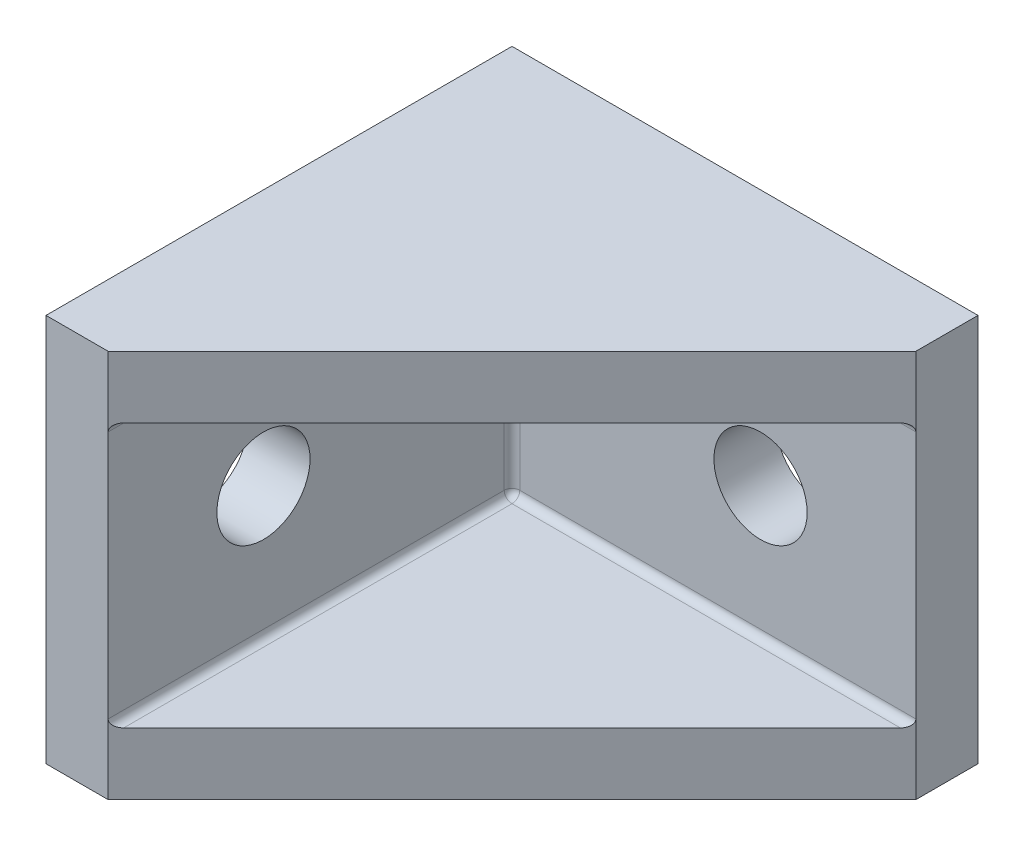
ISO-10303-21;
HEADER;
FILE_DESCRIPTION(('STEP AP214'),'2;1');
FILE_NAME('part.step','',(''),(''),'','','');
FILE_SCHEMA(('AUTOMOTIVE_DESIGN { 1 0 10303 214 1 1 1 1 }'));
ENDSEC;
DATA;
#1=APPLICATION_CONTEXT('core data for automotive mechanical design processes');
#2=APPLICATION_PROTOCOL_DEFINITION('international standard','automotive_design',2000,#1);
#3=PRODUCT_CONTEXT('',#1,'mechanical');
#4=PRODUCT('Part','Part','',(#3));
#5=PRODUCT_RELATED_PRODUCT_CATEGORY('part','',(#4));
#6=PRODUCT_DEFINITION_FORMATION('','',#4);
#7=PRODUCT_DEFINITION_CONTEXT('part definition',#1,'design');
#8=PRODUCT_DEFINITION('design','',#6,#7);
#9=PRODUCT_DEFINITION_SHAPE('','',#8);
#10=(LENGTH_UNIT() NAMED_UNIT(*) SI_UNIT(.MILLI.,.METRE.));
#11=(NAMED_UNIT(*) PLANE_ANGLE_UNIT() SI_UNIT($,.RADIAN.));
#12=(NAMED_UNIT(*) SI_UNIT($,.STERADIAN.) SOLID_ANGLE_UNIT());
#13=UNCERTAINTY_MEASURE_WITH_UNIT(LENGTH_MEASURE(1.E-05),#10,'distance_accuracy_value','');
#14=(GEOMETRIC_REPRESENTATION_CONTEXT(3) GLOBAL_UNCERTAINTY_ASSIGNED_CONTEXT((#13)) GLOBAL_UNIT_ASSIGNED_CONTEXT((#10,
#11,#12)) REPRESENTATION_CONTEXT('',''));
#15=CARTESIAN_POINT('',(0.,0.,0.));
#16=DIRECTION('',(0.,0.,1.));
#17=DIRECTION('',(1.,0.,0.));
#18=AXIS2_PLACEMENT_3D('',#15,#16,#17);
#19=CARTESIAN_POINT('',(30.,12.5,4.));
#20=DIRECTION('',(-0.707106781186547,0.,-0.707106781186547));
#21=DIRECTION('',(-0.707106781186548,0.,0.707106781186548));
#22=AXIS2_PLACEMENT_3D('',#19,#20,#21);
#23=PLANE('',#22);
#24=DIRECTION('',(0.707106781186548,0.,-0.707106781186548));
#25=VECTOR('',#24,1.);
#26=CARTESIAN_POINT('',(30.,-8.5,4.));
#27=LINE('',#26,#25);
#28=CARTESIAN_POINT('',(4.5,-8.5,29.5));
#29=VERTEX_POINT('',#28);
#30=CARTESIAN_POINT('',(29.5,-8.5,4.5));
#31=VERTEX_POINT('',#30);
#32=EDGE_CURVE('E131',#29,#31,#27,.T.);
#33=ORIENTED_EDGE('',*,*,#32,.F.);
#34=CARTESIAN_POINT('',(4.5,-8.,29.5));
#35=DIRECTION('',(-0.707106781186547,0.,-0.707106781186547));
#36=DIRECTION('',(0.707106781186548,0.,-0.707106781186548));
#37=AXIS2_PLACEMENT_3D('',#34,#35,#36);
#38=ELLIPSE('',#37,0.707106781186548,0.5);
#39=CARTESIAN_POINT('',(4.,-8.,30.));
#40=VERTEX_POINT('',#39);
#41=EDGE_CURVE('E11',#29,#40,#38,.T.);
#42=ORIENTED_EDGE('',*,*,#41,.T.);
#43=DIRECTION('',(0.,-1.,0.));
#44=VECTOR('',#43,1.);
#45=CARTESIAN_POINT('',(4.,12.5,30.));
#46=LINE('',#45,#44);
#47=CARTESIAN_POINT('',(4.,-12.5,30.));
#48=VERTEX_POINT('',#47);
#49=EDGE_CURVE('E52',#40,#48,#46,.T.);
#50=ORIENTED_EDGE('',*,*,#49,.T.);
#51=DIRECTION('',(0.707106781186547,0.,-0.707106781186547));
#52=VECTOR('',#51,1.);
#53=CARTESIAN_POINT('',(30.,-12.5,4.));
#54=LINE('',#53,#52);
#55=CARTESIAN_POINT('',(30.,-12.5,4.));
#56=VERTEX_POINT('',#55);
#57=EDGE_CURVE('E214',#48,#56,#54,.T.);
#58=ORIENTED_EDGE('',*,*,#57,.T.);
#59=DIRECTION('',(0.,-1.,0.));
#60=VECTOR('',#59,1.);
#61=CARTESIAN_POINT('',(30.,12.5,4.));
#62=LINE('',#61,#60);
#63=CARTESIAN_POINT('',(30.,-8.,4.));
#64=VERTEX_POINT('',#63);
#65=EDGE_CURVE('E80',#64,#56,#62,.T.);
#66=ORIENTED_EDGE('',*,*,#65,.F.);
#67=CARTESIAN_POINT('',(29.5,-8.,4.5));
#68=DIRECTION('',(-0.707106781186547,0.,-0.707106781186547));
#69=DIRECTION('',(0.707106781186548,0.,-0.707106781186548));
#70=AXIS2_PLACEMENT_3D('',#67,#68,#69);
#71=ELLIPSE('',#70,0.707106781186548,0.5);
#72=EDGE_CURVE('E44',#64,#31,#71,.T.);
#73=ORIENTED_EDGE('',*,*,#72,.T.);
#74=EDGE_LOOP('',(#33,#42,#50,#58,#66,#73));
#75=FACE_BOUND('',#74,.T.);
#76=ADVANCED_FACE('F35',(#75),#23,.F.);
#77=CARTESIAN_POINT('',(0.,12.5,0.));
#78=DIRECTION('',(0.,0.,1.));
#79=DIRECTION('',(1.,0.,0.));
#80=AXIS2_PLACEMENT_3D('',#77,#78,#79);
#81=PLANE('',#80);
#82=CARTESIAN_POINT('',(20.,0.,0.));
#83=DIRECTION('',(0.,0.,1.));
#84=DIRECTION('',(1.,0.,0.));
#85=AXIS2_PLACEMENT_3D('',#82,#83,#84);
#86=CIRCLE('',#85,3.);
#87=CARTESIAN_POINT('',(23.,0.,0.));
#88=VERTEX_POINT('',#87);
#89=EDGE_CURVE('E176',#88,#88,#86,.T.);
#90=ORIENTED_EDGE('',*,*,#89,.T.);
#91=EDGE_LOOP('',(#90));
#92=FACE_BOUND('',#91,.T.);
#93=DIRECTION('',(-1.,0.,0.));
#94=VECTOR('',#93,1.);
#95=CARTESIAN_POINT('',(0.,-12.5,0.));
#96=LINE('',#95,#94);
#97=CARTESIAN_POINT('',(30.,-12.5,0.));
#98=VERTEX_POINT('',#97);
#99=CARTESIAN_POINT('',(0.,-12.5,0.));
#100=VERTEX_POINT('',#99);
#101=EDGE_CURVE('E190',#98,#100,#96,.T.);
#102=ORIENTED_EDGE('',*,*,#101,.T.);
#103=DIRECTION('',(0.,-1.,0.));
#104=VECTOR('',#103,1.);
#105=CARTESIAN_POINT('',(0.,12.5,0.));
#106=LINE('',#105,#104);
#107=CARTESIAN_POINT('',(0.,12.5,0.));
#108=VERTEX_POINT('',#107);
#109=EDGE_CURVE('E225',#108,#100,#106,.T.);
#110=ORIENTED_EDGE('',*,*,#109,.F.);
#111=DIRECTION('',(-1.,0.,0.));
#112=VECTOR('',#111,1.);
#113=CARTESIAN_POINT('',(0.,12.5,0.));
#114=LINE('',#113,#112);
#115=CARTESIAN_POINT('',(30.,12.5,0.));
#116=VERTEX_POINT('',#115);
#117=EDGE_CURVE('E195',#116,#108,#114,.T.);
#118=ORIENTED_EDGE('',*,*,#117,.F.);
#119=DIRECTION('',(0.,-1.,0.));
#120=VECTOR('',#119,1.);
#121=CARTESIAN_POINT('',(30.,12.5,0.));
#122=LINE('',#121,#120);
#123=EDGE_CURVE('E207',#116,#98,#122,.T.);
#124=ORIENTED_EDGE('',*,*,#123,.T.);
#125=EDGE_LOOP('',(#102,#110,#118,#124));
#126=FACE_BOUND('',#125,.T.);
#127=ADVANCED_FACE('F267',(#92,#126),#81,.F.);
#128=CARTESIAN_POINT('',(0.,12.5,0.));
#129=DIRECTION('',(1.,0.,0.));
#130=DIRECTION('',(0.,0.,-1.));
#131=AXIS2_PLACEMENT_3D('',#128,#129,#130);
#132=PLANE('',#131);
#133=CARTESIAN_POINT('',(0.,0.,20.));
#134=DIRECTION('',(1.,0.,0.));
#135=DIRECTION('',(0.,0.,-1.));
#136=AXIS2_PLACEMENT_3D('',#133,#134,#135);
#137=CIRCLE('',#136,3.);
#138=CARTESIAN_POINT('',(0.,0.,17.));
#139=VERTEX_POINT('',#138);
#140=EDGE_CURVE('E144',#139,#139,#137,.T.);
#141=ORIENTED_EDGE('',*,*,#140,.T.);
#142=EDGE_LOOP('',(#141));
#143=FACE_BOUND('',#142,.T.);
#144=DIRECTION('',(0.,0.,1.));
#145=VECTOR('',#144,1.);
#146=CARTESIAN_POINT('',(0.,-12.5,0.));
#147=LINE('',#146,#145);
#148=CARTESIAN_POINT('',(0.,-12.5,30.));
#149=VERTEX_POINT('',#148);
#150=EDGE_CURVE('E210',#100,#149,#147,.T.);
#151=ORIENTED_EDGE('',*,*,#150,.T.);
#152=DIRECTION('',(0.,-1.,0.));
#153=VECTOR('',#152,1.);
#154=CARTESIAN_POINT('',(0.,12.5,30.));
#155=LINE('',#154,#153);
#156=CARTESIAN_POINT('',(0.,12.5,30.));
#157=VERTEX_POINT('',#156);
#158=EDGE_CURVE('E222',#157,#149,#155,.T.);
#159=ORIENTED_EDGE('',*,*,#158,.F.);
#160=DIRECTION('',(0.,0.,1.));
#161=VECTOR('',#160,1.);
#162=CARTESIAN_POINT('',(0.,12.5,0.));
#163=LINE('',#162,#161);
#164=EDGE_CURVE('E197',#108,#157,#163,.T.);
#165=ORIENTED_EDGE('',*,*,#164,.F.);
#166=ORIENTED_EDGE('',*,*,#109,.T.);
#167=EDGE_LOOP('',(#151,#159,#165,#166));
#168=FACE_BOUND('',#167,.T.);
#169=ADVANCED_FACE('F298',(#143,#168),#132,.F.);
#170=CARTESIAN_POINT('',(0.,12.5,30.));
#171=DIRECTION('',(0.,0.,-1.));
#172=DIRECTION('',(-1.,0.,0.));
#173=AXIS2_PLACEMENT_3D('',#170,#171,#172);
#174=PLANE('',#173);
#175=DIRECTION('',(1.,0.,0.));
#176=VECTOR('',#175,1.);
#177=CARTESIAN_POINT('',(0.,-12.5,30.));
#178=LINE('',#177,#176);
#179=EDGE_CURVE('E212',#149,#48,#178,.T.);
#180=ORIENTED_EDGE('',*,*,#179,.T.);
#181=ORIENTED_EDGE('',*,*,#49,.F.);
#182=DIRECTION('',(0.,-1.,0.));
#183=VECTOR('',#182,1.);
#184=CARTESIAN_POINT('',(4.,12.5,30.));
#185=LINE('',#184,#183);
#186=CARTESIAN_POINT('',(4.,8.,30.));
#187=VERTEX_POINT('',#186);
#188=EDGE_CURVE('E188',#187,#40,#185,.T.);
#189=ORIENTED_EDGE('',*,*,#188,.F.);
#190=CARTESIAN_POINT('',(4.,12.5,30.));
#191=VERTEX_POINT('',#190);
#192=EDGE_CURVE('E220',#191,#187,#46,.T.);
#193=ORIENTED_EDGE('',*,*,#192,.F.);
#194=DIRECTION('',(1.,0.,0.));
#195=VECTOR('',#194,1.);
#196=CARTESIAN_POINT('',(0.,12.5,30.));
#197=LINE('',#196,#195);
#198=EDGE_CURVE('E201',#157,#191,#197,.T.);
#199=ORIENTED_EDGE('',*,*,#198,.F.);
#200=ORIENTED_EDGE('',*,*,#158,.T.);
#201=EDGE_LOOP('',(#180,#181,#189,#193,#199,#200));
#202=FACE_BOUND('',#201,.T.);
#203=ADVANCED_FACE('F279',(#202),#174,.F.);
#204=ORIENTED_EDGE('',*,*,#192,.T.);
#205=CARTESIAN_POINT('',(4.5,8.,29.5));
#206=DIRECTION('',(-0.707106781186547,0.,-0.707106781186547));
#207=DIRECTION('',(-0.707106781186548,0.,0.707106781186548));
#208=AXIS2_PLACEMENT_3D('',#205,#206,#207);
#209=ELLIPSE('',#208,0.707106781186548,0.5);
#210=CARTESIAN_POINT('',(4.5,8.5,29.5));
#211=VERTEX_POINT('',#210);
#212=EDGE_CURVE('E136',#187,#211,#209,.T.);
#213=ORIENTED_EDGE('',*,*,#212,.T.);
#214=DIRECTION('',(0.707106781186548,0.,-0.707106781186548));
#215=VECTOR('',#214,1.);
#216=CARTESIAN_POINT('',(30.,8.5,4.));
#217=LINE('',#216,#215);
#218=CARTESIAN_POINT('',(29.5,8.5,4.5));
#219=VERTEX_POINT('',#218);
#220=EDGE_CURVE('E143',#211,#219,#217,.T.);
#221=ORIENTED_EDGE('',*,*,#220,.T.);
#222=CARTESIAN_POINT('',(29.5,8.,4.5));
#223=DIRECTION('',(-0.707106781186547,0.,-0.707106781186547));
#224=DIRECTION('',(-0.707106781186548,0.,0.707106781186548));
#225=AXIS2_PLACEMENT_3D('',#222,#223,#224);
#226=ELLIPSE('',#225,0.707106781186548,0.5);
#227=CARTESIAN_POINT('',(30.,8.,4.));
#228=VERTEX_POINT('',#227);
#229=EDGE_CURVE('E151',#219,#228,#226,.T.);
#230=ORIENTED_EDGE('',*,*,#229,.T.);
#231=CARTESIAN_POINT('',(30.,12.5,4.));
#232=VERTEX_POINT('',#231);
#233=EDGE_CURVE('E61',#232,#228,#62,.T.);
#234=ORIENTED_EDGE('',*,*,#233,.F.);
#235=DIRECTION('',(0.707106781186547,0.,-0.707106781186547));
#236=VECTOR('',#235,1.);
#237=CARTESIAN_POINT('',(30.,12.5,4.));
#238=LINE('',#237,#236);
#239=EDGE_CURVE('E204',#191,#232,#238,.T.);
#240=ORIENTED_EDGE('',*,*,#239,.F.);
#241=EDGE_LOOP('',(#204,#213,#221,#230,#234,#240));
#242=FACE_BOUND('',#241,.T.);
#243=ADVANCED_FACE('F251',(#242),#23,.F.);
#244=CARTESIAN_POINT('',(30.,12.5,4.));
#245=DIRECTION('',(-1.,0.,0.));
#246=DIRECTION('',(0.,0.,1.));
#247=AXIS2_PLACEMENT_3D('',#244,#245,#246);
#248=PLANE('',#247);
#249=DIRECTION('',(0.,0.,-1.));
#250=VECTOR('',#249,1.);
#251=CARTESIAN_POINT('',(30.,-12.5,4.));
#252=LINE('',#251,#250);
#253=EDGE_CURVE('E198',#56,#98,#252,.T.);
#254=ORIENTED_EDGE('',*,*,#253,.T.);
#255=ORIENTED_EDGE('',*,*,#123,.F.);
#256=DIRECTION('',(0.,0.,-1.));
#257=VECTOR('',#256,1.);
#258=CARTESIAN_POINT('',(30.,12.5,4.));
#259=LINE('',#258,#257);
#260=EDGE_CURVE('E90',#232,#116,#259,.T.);
#261=ORIENTED_EDGE('',*,*,#260,.F.);
#262=ORIENTED_EDGE('',*,*,#233,.T.);
#263=DIRECTION('',(0.,-1.,0.));
#264=VECTOR('',#263,1.);
#265=CARTESIAN_POINT('',(30.,12.5,4.));
#266=LINE('',#265,#264);
#267=EDGE_CURVE('E191',#228,#64,#266,.T.);
#268=ORIENTED_EDGE('',*,*,#267,.T.);
#269=ORIENTED_EDGE('',*,*,#65,.T.);
#270=EDGE_LOOP('',(#254,#255,#261,#262,#268,#269));
#271=FACE_BOUND('',#270,.T.);
#272=ADVANCED_FACE('F258',(#271),#248,.F.);
#273=CARTESIAN_POINT('',(0.,12.5,0.));
#274=DIRECTION('',(0.,1.,0.));
#275=DIRECTION('',(0.,0.,1.));
#276=AXIS2_PLACEMENT_3D('',#273,#274,#275);
#277=PLANE('',#276);
#278=ORIENTED_EDGE('',*,*,#117,.T.);
#279=ORIENTED_EDGE('',*,*,#164,.T.);
#280=ORIENTED_EDGE('',*,*,#198,.T.);
#281=ORIENTED_EDGE('',*,*,#239,.T.);
#282=ORIENTED_EDGE('',*,*,#260,.T.);
#283=EDGE_LOOP('',(#278,#279,#280,#281,#282));
#284=FACE_BOUND('',#283,.T.);
#285=ADVANCED_FACE('F269',(#284),#277,.T.);
#286=CARTESIAN_POINT('',(0.,-12.5,0.));
#287=DIRECTION('',(0.,1.,0.));
#288=DIRECTION('',(0.,0.,1.));
#289=AXIS2_PLACEMENT_3D('',#286,#287,#288);
#290=PLANE('',#289);
#291=ORIENTED_EDGE('',*,*,#101,.F.);
#292=ORIENTED_EDGE('',*,*,#253,.F.);
#293=ORIENTED_EDGE('',*,*,#57,.F.);
#294=ORIENTED_EDGE('',*,*,#179,.F.);
#295=ORIENTED_EDGE('',*,*,#150,.F.);
#296=EDGE_LOOP('',(#291,#292,#293,#294,#295));
#297=FACE_BOUND('',#296,.T.);
#298=ADVANCED_FACE('F264',(#297),#290,.F.);
#299=CARTESIAN_POINT('',(0.,12.5,4.));
#300=DIRECTION('',(0.,0.,1.));
#301=DIRECTION('',(1.,0.,0.));
#302=AXIS2_PLACEMENT_3D('',#299,#300,#301);
#303=PLANE('',#302);
#304=CARTESIAN_POINT('',(20.,0.,4.));
#305=DIRECTION('',(0.,0.,1.));
#306=DIRECTION('',(1.,0.,0.));
#307=AXIS2_PLACEMENT_3D('',#304,#305,#306);
#308=CIRCLE('',#307,3.);
#309=CARTESIAN_POINT('',(23.,0.,4.));
#310=VERTEX_POINT('',#309);
#311=EDGE_CURVE('E173',#310,#310,#308,.T.);
#312=ORIENTED_EDGE('',*,*,#311,.F.);
#313=EDGE_LOOP('',(#312));
#314=FACE_BOUND('',#313,.T.);
#315=ORIENTED_EDGE('',*,*,#267,.F.);
#316=DIRECTION('',(-1.,0.,0.));
#317=VECTOR('',#316,1.);
#318=CARTESIAN_POINT('',(0.,8.,4.));
#319=LINE('',#318,#317);
#320=CARTESIAN_POINT('',(4.5,8.,4.));
#321=VERTEX_POINT('',#320);
#322=EDGE_CURVE('E233',#228,#321,#319,.T.);
#323=ORIENTED_EDGE('',*,*,#322,.T.);
#324=DIRECTION('',(0.,-1.,0.));
#325=VECTOR('',#324,1.);
#326=CARTESIAN_POINT('',(4.5,-8.5,4.));
#327=LINE('',#326,#325);
#328=CARTESIAN_POINT('',(4.5,-8.,4.));
#329=VERTEX_POINT('',#328);
#330=EDGE_CURVE('E230',#321,#329,#327,.T.);
#331=ORIENTED_EDGE('',*,*,#330,.T.);
#332=DIRECTION('',(-1.,0.,0.));
#333=VECTOR('',#332,1.);
#334=CARTESIAN_POINT('',(30.,-8.,4.));
#335=LINE('',#334,#333);
#336=EDGE_CURVE('E228',#329,#64,#335,.F.);
#337=ORIENTED_EDGE('',*,*,#336,.T.);
#338=EDGE_LOOP('',(#315,#323,#331,#337));
#339=FACE_BOUND('',#338,.T.);
#340=ADVANCED_FACE('F256',(#314,#339),#303,.T.);
#341=CARTESIAN_POINT('',(4.,12.5,0.));
#342=DIRECTION('',(1.,0.,0.));
#343=DIRECTION('',(0.,0.,-1.));
#344=AXIS2_PLACEMENT_3D('',#341,#342,#343);
#345=PLANE('',#344);
#346=CARTESIAN_POINT('',(4.,0.,20.));
#347=DIRECTION('',(1.,0.,0.));
#348=DIRECTION('',(0.,0.,-1.));
#349=AXIS2_PLACEMENT_3D('',#346,#347,#348);
#350=CIRCLE('',#349,3.);
#351=CARTESIAN_POINT('',(4.,0.,17.));
#352=VERTEX_POINT('',#351);
#353=EDGE_CURVE('E181',#352,#352,#350,.T.);
#354=ORIENTED_EDGE('',*,*,#353,.F.);
#355=EDGE_LOOP('',(#354));
#356=FACE_BOUND('',#355,.T.);
#357=DIRECTION('',(0.,-1.,0.));
#358=VECTOR('',#357,1.);
#359=CARTESIAN_POINT('',(4.,8.5,4.5));
#360=LINE('',#359,#358);
#361=CARTESIAN_POINT('',(4.,-8.,4.5));
#362=VERTEX_POINT('',#361);
#363=CARTESIAN_POINT('',(4.,8.,4.5));
#364=VERTEX_POINT('',#363);
#365=EDGE_CURVE('E237',#362,#364,#360,.F.);
#366=ORIENTED_EDGE('',*,*,#365,.T.);
#367=DIRECTION('',(0.,0.,1.));
#368=VECTOR('',#367,1.);
#369=CARTESIAN_POINT('',(4.,8.,0.));
#370=LINE('',#369,#368);
#371=EDGE_CURVE('E239',#364,#187,#370,.T.);
#372=ORIENTED_EDGE('',*,*,#371,.T.);
#373=ORIENTED_EDGE('',*,*,#188,.T.);
#374=DIRECTION('',(0.,0.,1.));
#375=VECTOR('',#374,1.);
#376=CARTESIAN_POINT('',(4.,-8.,4.));
#377=LINE('',#376,#375);
#378=EDGE_CURVE('E235',#40,#362,#377,.F.);
#379=ORIENTED_EDGE('',*,*,#378,.T.);
#380=EDGE_LOOP('',(#366,#372,#373,#379));
#381=FACE_BOUND('',#380,.T.);
#382=ADVANCED_FACE('F282',(#356,#381),#345,.T.);
#383=CARTESIAN_POINT('',(0.,8.5,0.));
#384=DIRECTION('',(0.,1.,0.));
#385=DIRECTION('',(0.,0.,1.));
#386=AXIS2_PLACEMENT_3D('',#383,#384,#385);
#387=PLANE('',#386);
#388=DIRECTION('',(0.,0.,1.));
#389=VECTOR('',#388,1.);
#390=CARTESIAN_POINT('',(4.5,8.5,0.));
#391=LINE('',#390,#389);
#392=CARTESIAN_POINT('',(4.5,8.5,4.5));
#393=VERTEX_POINT('',#392);
#394=EDGE_CURVE('E242',#211,#393,#391,.F.);
#395=ORIENTED_EDGE('',*,*,#394,.T.);
#396=DIRECTION('',(-1.,0.,0.));
#397=VECTOR('',#396,1.);
#398=CARTESIAN_POINT('',(0.,8.5,4.5));
#399=LINE('',#398,#397);
#400=EDGE_CURVE('E155',#393,#219,#399,.F.);
#401=ORIENTED_EDGE('',*,*,#400,.T.);
#402=ORIENTED_EDGE('',*,*,#220,.F.);
#403=EDGE_LOOP('',(#395,#401,#402));
#404=FACE_BOUND('',#403,.T.);
#405=ADVANCED_FACE('F246',(#404),#387,.F.);
#406=CARTESIAN_POINT('',(0.,-8.5,0.));
#407=DIRECTION('',(0.,1.,0.));
#408=DIRECTION('',(0.,0.,1.));
#409=AXIS2_PLACEMENT_3D('',#406,#407,#408);
#410=PLANE('',#409);
#411=ORIENTED_EDGE('',*,*,#32,.T.);
#412=DIRECTION('',(-1.,0.,0.));
#413=VECTOR('',#412,1.);
#414=CARTESIAN_POINT('',(4.,-8.5,4.5));
#415=LINE('',#414,#413);
#416=CARTESIAN_POINT('',(4.5,-8.5,4.5));
#417=VERTEX_POINT('',#416);
#418=EDGE_CURVE('E140',#31,#417,#415,.T.);
#419=ORIENTED_EDGE('',*,*,#418,.T.);
#420=DIRECTION('',(0.,0.,1.));
#421=VECTOR('',#420,1.);
#422=CARTESIAN_POINT('',(4.5,-8.5,30.));
#423=LINE('',#422,#421);
#424=EDGE_CURVE('E142',#417,#29,#423,.T.);
#425=ORIENTED_EDGE('',*,*,#424,.T.);
#426=EDGE_LOOP('',(#411,#419,#425));
#427=FACE_BOUND('',#426,.T.);
#428=ADVANCED_FACE('F139',(#427),#410,.T.);
#429=CARTESIAN_POINT('',(-46.,0.,20.));
#430=DIRECTION('',(1.,0.,0.));
#431=DIRECTION('',(0.,0.,-1.));
#432=AXIS2_PLACEMENT_3D('',#429,#430,#431);
#433=CYLINDRICAL_SURFACE('',#432,3.);
#434=ORIENTED_EDGE('',*,*,#353,.T.);
#435=EDGE_LOOP('',(#434));
#436=FACE_BOUND('',#435,.T.);
#437=ORIENTED_EDGE('',*,*,#140,.F.);
#438=EDGE_LOOP('',(#437));
#439=FACE_BOUND('',#438,.T.);
#440=ADVANCED_FACE('F291',(#436,#439),#433,.F.);
#441=CARTESIAN_POINT('',(20.,0.,-46.));
#442=DIRECTION('',(0.,0.,1.));
#443=DIRECTION('',(1.,0.,0.));
#444=AXIS2_PLACEMENT_3D('',#441,#442,#443);
#445=CYLINDRICAL_SURFACE('',#444,3.);
#446=ORIENTED_EDGE('',*,*,#311,.T.);
#447=EDGE_LOOP('',(#446));
#448=FACE_BOUND('',#447,.T.);
#449=ORIENTED_EDGE('',*,*,#89,.F.);
#450=EDGE_LOOP('',(#449));
#451=FACE_BOUND('',#450,.T.);
#452=ADVANCED_FACE('F286',(#448,#451),#445,.F.);
#453=CARTESIAN_POINT('',(4.5,8.,0.));
#454=DIRECTION('',(0.,0.,1.));
#455=DIRECTION('',(1.,0.,0.));
#456=AXIS2_PLACEMENT_3D('',#453,#454,#455);
#457=CYLINDRICAL_SURFACE('',#456,0.5);
#458=ORIENTED_EDGE('',*,*,#212,.F.);
#459=ORIENTED_EDGE('',*,*,#371,.F.);
#460=CARTESIAN_POINT('',(4.5,8.,4.5));
#461=DIRECTION('',(0.,0.,1.));
#462=DIRECTION('',(1.,0.,0.));
#463=AXIS2_PLACEMENT_3D('',#460,#461,#462);
#464=CIRCLE('',#463,0.5);
#465=EDGE_CURVE('E39',#393,#364,#464,.T.);
#466=ORIENTED_EDGE('',*,*,#465,.F.);
#467=ORIENTED_EDGE('',*,*,#394,.F.);
#468=EDGE_LOOP('',(#458,#459,#466,#467));
#469=FACE_BOUND('',#468,.T.);
#470=ADVANCED_FACE('F37',(#469),#457,.F.);
#471=CARTESIAN_POINT('',(0.,8.,4.5));
#472=DIRECTION('',(-1.,0.,0.));
#473=DIRECTION('',(0.,0.,1.));
#474=AXIS2_PLACEMENT_3D('',#471,#472,#473);
#475=CYLINDRICAL_SURFACE('',#474,0.5);
#476=ORIENTED_EDGE('',*,*,#229,.F.);
#477=ORIENTED_EDGE('',*,*,#400,.F.);
#478=CARTESIAN_POINT('',(4.5,8.,4.5));
#479=DIRECTION('',(1.,0.,0.));
#480=DIRECTION('',(0.,0.,-1.));
#481=AXIS2_PLACEMENT_3D('',#478,#479,#480);
#482=CIRCLE('',#481,0.5);
#483=EDGE_CURVE('E167',#321,#393,#482,.T.);
#484=ORIENTED_EDGE('',*,*,#483,.F.);
#485=ORIENTED_EDGE('',*,*,#322,.F.);
#486=EDGE_LOOP('',(#476,#477,#484,#485));
#487=FACE_BOUND('',#486,.T.);
#488=ADVANCED_FACE('F254',(#487),#475,.F.);
#489=CARTESIAN_POINT('',(0.,-8.,4.5));
#490=DIRECTION('',(1.,0.,0.));
#491=DIRECTION('',(0.,0.,-1.));
#492=AXIS2_PLACEMENT_3D('',#489,#490,#491);
#493=CYLINDRICAL_SURFACE('',#492,0.5);
#494=ORIENTED_EDGE('',*,*,#72,.F.);
#495=ORIENTED_EDGE('',*,*,#336,.F.);
#496=CARTESIAN_POINT('',(4.5,-8.,4.5));
#497=DIRECTION('',(1.,0.,0.));
#498=DIRECTION('',(0.,0.,-1.));
#499=AXIS2_PLACEMENT_3D('',#496,#497,#498);
#500=CIRCLE('',#499,0.5);
#501=EDGE_CURVE('E149',#417,#329,#500,.T.);
#502=ORIENTED_EDGE('',*,*,#501,.F.);
#503=ORIENTED_EDGE('',*,*,#418,.F.);
#504=EDGE_LOOP('',(#494,#495,#502,#503));
#505=FACE_BOUND('',#504,.T.);
#506=ADVANCED_FACE('F147',(#505),#493,.F.);
#507=CARTESIAN_POINT('',(4.5,-8.,0.));
#508=DIRECTION('',(0.,0.,-1.));
#509=DIRECTION('',(-1.,0.,0.));
#510=AXIS2_PLACEMENT_3D('',#507,#508,#509);
#511=CYLINDRICAL_SURFACE('',#510,0.5);
#512=ORIENTED_EDGE('',*,*,#41,.F.);
#513=ORIENTED_EDGE('',*,*,#424,.F.);
#514=CARTESIAN_POINT('',(4.5,-8.,4.5));
#515=DIRECTION('',(0.,0.,1.));
#516=DIRECTION('',(1.,0.,0.));
#517=AXIS2_PLACEMENT_3D('',#514,#515,#516);
#518=CIRCLE('',#517,0.5);
#519=EDGE_CURVE('E165',#362,#417,#518,.T.);
#520=ORIENTED_EDGE('',*,*,#519,.F.);
#521=ORIENTED_EDGE('',*,*,#378,.F.);
#522=EDGE_LOOP('',(#512,#513,#520,#521));
#523=FACE_BOUND('',#522,.T.);
#524=ADVANCED_FACE('F325',(#523),#511,.F.);
#525=CARTESIAN_POINT('',(4.5,8.,4.5));
#526=DIRECTION('',(0.,0.,1.));
#527=DIRECTION('',(1.,0.,0.));
#528=AXIS2_PLACEMENT_3D('',#525,#526,#527);
#529=SPHERICAL_SURFACE('',#528,0.5);
#530=ORIENTED_EDGE('',*,*,#483,.T.);
#531=ORIENTED_EDGE('',*,*,#465,.T.);
#532=CARTESIAN_POINT('',(4.5,8.,4.5));
#533=DIRECTION('',(0.,-1.,0.));
#534=DIRECTION('',(0.,0.,-1.));
#535=AXIS2_PLACEMENT_3D('',#532,#533,#534);
#536=CIRCLE('',#535,0.5);
#537=EDGE_CURVE('E162',#321,#364,#536,.F.);
#538=ORIENTED_EDGE('',*,*,#537,.F.);
#539=EDGE_LOOP('',(#530,#531,#538));
#540=FACE_BOUND('',#539,.T.);
#541=ADVANCED_FACE('F321',(#540),#529,.F.);
#542=CARTESIAN_POINT('',(4.5,-8.,4.5));
#543=DIRECTION('',(0.,0.,1.));
#544=DIRECTION('',(1.,0.,0.));
#545=AXIS2_PLACEMENT_3D('',#542,#543,#544);
#546=SPHERICAL_SURFACE('',#545,0.5);
#547=ORIENTED_EDGE('',*,*,#519,.T.);
#548=ORIENTED_EDGE('',*,*,#501,.T.);
#549=CARTESIAN_POINT('',(4.5,-8.,4.5));
#550=DIRECTION('',(0.,1.,0.));
#551=DIRECTION('',(0.,0.,1.));
#552=AXIS2_PLACEMENT_3D('',#549,#550,#551);
#553=CIRCLE('',#552,0.5);
#554=EDGE_CURVE('E160',#362,#329,#553,.F.);
#555=ORIENTED_EDGE('',*,*,#554,.F.);
#556=EDGE_LOOP('',(#547,#548,#555));
#557=FACE_BOUND('',#556,.T.);
#558=ADVANCED_FACE('F317',(#557),#546,.F.);
#559=CARTESIAN_POINT('',(4.5,12.5,4.5));
#560=DIRECTION('',(0.,1.,0.));
#561=DIRECTION('',(0.,0.,1.));
#562=AXIS2_PLACEMENT_3D('',#559,#560,#561);
#563=CYLINDRICAL_SURFACE('',#562,0.5);
#564=ORIENTED_EDGE('',*,*,#537,.T.);
#565=ORIENTED_EDGE('',*,*,#365,.F.);
#566=ORIENTED_EDGE('',*,*,#554,.T.);
#567=ORIENTED_EDGE('',*,*,#330,.F.);
#568=EDGE_LOOP('',(#564,#565,#566,#567));
#569=FACE_BOUND('',#568,.T.);
#570=ADVANCED_FACE('F314',(#569),#563,.F.);
#571=CLOSED_SHELL('',(#76,#127,#169,#203,#243,#272,#285,#298,#340,#382,#405,#428,#440,#452,#470,
#488,#506,#524,#541,#558,#570));
#572=MANIFOLD_SOLID_BREP('B2',#571);
#573=ADVANCED_BREP_SHAPE_REPRESENTATION('',(#18,#572),#14);
#574=SHAPE_DEFINITION_REPRESENTATION(#9,#573);
ENDSEC;
END-ISO-10303-21;
